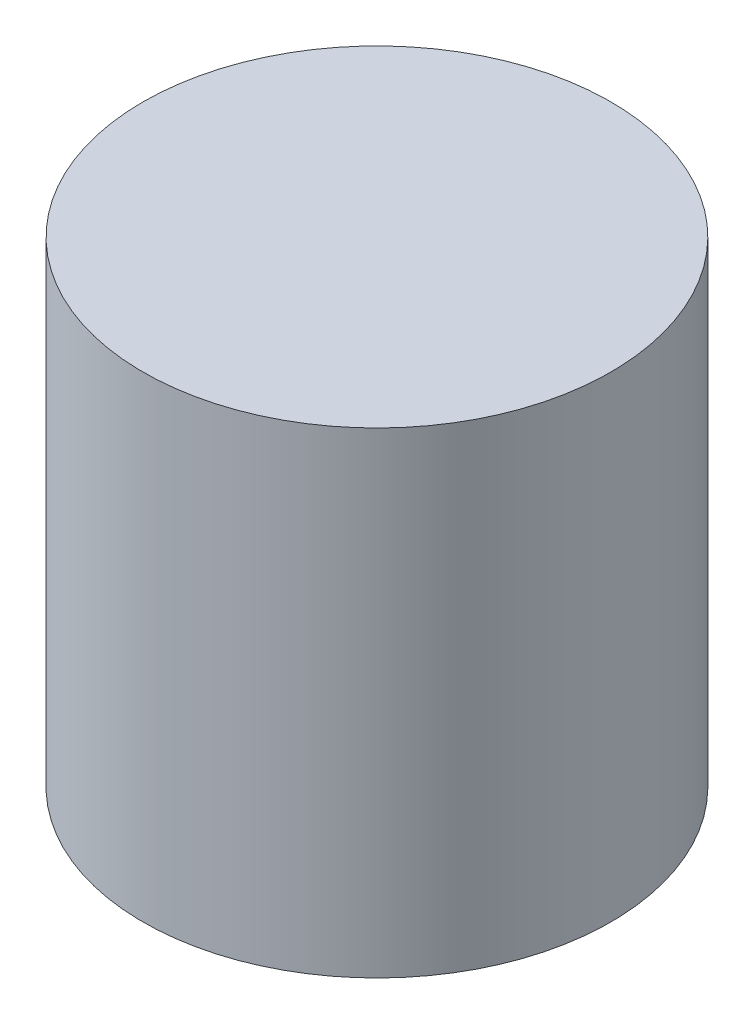
ISO-10303-21;
HEADER;
FILE_DESCRIPTION(('STEP AP214'),'2;1');
FILE_NAME('part.step','',(''),(''),'','','');
FILE_SCHEMA(('AUTOMOTIVE_DESIGN { 1 0 10303 214 1 1 1 1 }'));
ENDSEC;
DATA;
#1=APPLICATION_CONTEXT('core data for automotive mechanical design processes');
#2=APPLICATION_PROTOCOL_DEFINITION('international standard','automotive_design',2000,#1);
#3=PRODUCT_CONTEXT('',#1,'mechanical');
#4=PRODUCT('Part','Part','',(#3));
#5=PRODUCT_RELATED_PRODUCT_CATEGORY('part','',(#4));
#6=PRODUCT_DEFINITION_FORMATION('','',#4);
#7=PRODUCT_DEFINITION_CONTEXT('part definition',#1,'design');
#8=PRODUCT_DEFINITION('design','',#6,#7);
#9=PRODUCT_DEFINITION_SHAPE('','',#8);
#10=(LENGTH_UNIT() NAMED_UNIT(*) SI_UNIT(.MILLI.,.METRE.));
#11=(NAMED_UNIT(*) PLANE_ANGLE_UNIT() SI_UNIT($,.RADIAN.));
#12=(NAMED_UNIT(*) SI_UNIT($,.STERADIAN.) SOLID_ANGLE_UNIT());
#13=UNCERTAINTY_MEASURE_WITH_UNIT(LENGTH_MEASURE(1.E-05),#10,'distance_accuracy_value','');
#14=(GEOMETRIC_REPRESENTATION_CONTEXT(3) GLOBAL_UNCERTAINTY_ASSIGNED_CONTEXT((#13)) GLOBAL_UNIT_ASSIGNED_CONTEXT((#10,
#11,#12)) REPRESENTATION_CONTEXT('',''));
#15=CARTESIAN_POINT('',(0.,0.,0.));
#16=DIRECTION('',(0.,0.,1.));
#17=DIRECTION('',(1.,0.,0.));
#18=AXIS2_PLACEMENT_3D('',#15,#16,#17);
#19=CARTESIAN_POINT('',(0.,5.7,0.));
#20=DIRECTION('',(0.,1.,0.));
#21=DIRECTION('',(1.,0.,0.));
#22=AXIS2_PLACEMENT_3D('',#19,#20,#21);
#23=PLANE('',#22);
#24=CARTESIAN_POINT('',(0.,5.7,0.));
#25=DIRECTION('',(0.,1.,0.));
#26=DIRECTION('',(1.,0.,0.));
#27=AXIS2_PLACEMENT_3D('',#24,#25,#26);
#28=CIRCLE('',#27,2.8);
#29=CARTESIAN_POINT('',(-2.8,5.7,0.));
#30=VERTEX_POINT('',#29);
#31=EDGE_CURVE('E11',#30,#30,#28,.T.);
#32=ORIENTED_EDGE('',*,*,#31,.T.);
#33=EDGE_LOOP('',(#32));
#34=FACE_BOUND('',#33,.T.);
#35=ADVANCED_FACE('F16',(#34),#23,.T.);
#36=CARTESIAN_POINT('',(0.,0.,0.));
#37=DIRECTION('',(0.,1.,0.));
#38=DIRECTION('',(1.,0.,0.));
#39=AXIS2_PLACEMENT_3D('',#36,#37,#38);
#40=CYLINDRICAL_SURFACE('',#39,2.8);
#41=CARTESIAN_POINT('',(0.,0.,0.));
#42=DIRECTION('',(0.,1.,0.));
#43=DIRECTION('',(1.,0.,0.));
#44=AXIS2_PLACEMENT_3D('',#41,#42,#43);
#45=CIRCLE('',#44,2.8);
#46=CARTESIAN_POINT('',(-2.8,0.,0.));
#47=VERTEX_POINT('',#46);
#48=EDGE_CURVE('E211',#47,#47,#45,.T.);
#49=ORIENTED_EDGE('',*,*,#48,.T.);
#50=EDGE_LOOP('',(#49));
#51=FACE_BOUND('',#50,.T.);
#52=ORIENTED_EDGE('',*,*,#31,.F.);
#53=EDGE_LOOP('',(#52));
#54=FACE_BOUND('',#53,.T.);
#55=ADVANCED_FACE('F595',(#51,#54),#40,.T.);
#56=CARTESIAN_POINT('',(-2.05,0.,0.585));
#57=DIRECTION('',(1.,0.,0.));
#58=DIRECTION('',(0.,1.,0.));
#59=AXIS2_PLACEMENT_3D('',#56,#57,#58);
#60=PLANE('',#59);
#61=DIRECTION('',(0.,0.,1.));
#62=VECTOR('',#61,1.);
#63=CARTESIAN_POINT('',(-2.05,0.3,0.2925));
#64=LINE('',#63,#62);
#65=CARTESIAN_POINT('',(-2.05,0.3,-0.585));
#66=VERTEX_POINT('',#65);
#67=CARTESIAN_POINT('',(-2.05,0.3,0.585));
#68=VERTEX_POINT('',#67);
#69=EDGE_CURVE('E305',#66,#68,#64,.T.);
#70=ORIENTED_EDGE('',*,*,#69,.F.);
#71=DIRECTION('',(0.,1.,0.));
#72=VECTOR('',#71,1.);
#73=CARTESIAN_POINT('',(-2.05,0.,-0.585));
#74=LINE('',#73,#72);
#75=CARTESIAN_POINT('',(-2.05,4.7,-0.585));
#76=VERTEX_POINT('',#75);
#77=EDGE_CURVE('E27',#66,#76,#74,.T.);
#78=ORIENTED_EDGE('',*,*,#77,.T.);
#79=DIRECTION('',(0.,0.,1.));
#80=VECTOR('',#79,1.);
#81=CARTESIAN_POINT('',(-2.05,4.7,0.2925));
#82=LINE('',#81,#80);
#83=CARTESIAN_POINT('',(-2.05,4.7,0.585));
#84=VERTEX_POINT('',#83);
#85=EDGE_CURVE('E263',#76,#84,#82,.T.);
#86=ORIENTED_EDGE('',*,*,#85,.T.);
#87=DIRECTION('',(0.,1.,0.));
#88=VECTOR('',#87,1.);
#89=CARTESIAN_POINT('',(-2.05,0.,0.585));
#90=LINE('',#89,#88);
#91=EDGE_CURVE('E298',#68,#84,#90,.T.);
#92=ORIENTED_EDGE('',*,*,#91,.F.);
#93=EDGE_LOOP('',(#70,#78,#86,#92));
#94=FACE_BOUND('',#93,.T.);
#95=ADVANCED_FACE('F404',(#94),#60,.T.);
#96=CARTESIAN_POINT('',(-2.05,0.,-0.585));
#97=DIRECTION('',(0.,0.,1.));
#98=DIRECTION('',(1.,0.,0.));
#99=AXIS2_PLACEMENT_3D('',#96,#97,#98);
#100=PLANE('',#99);
#101=DIRECTION('',(-1.,0.,0.));
#102=VECTOR('',#101,1.);
#103=CARTESIAN_POINT('',(-1.025,0.3,-0.585));
#104=LINE('',#103,#102);
#105=CARTESIAN_POINT('',(-0.585,0.3,-0.585));
#106=VERTEX_POINT('',#105);
#107=EDGE_CURVE('E238',#106,#66,#104,.T.);
#108=ORIENTED_EDGE('',*,*,#107,.F.);
#109=DIRECTION('',(0.,1.,0.));
#110=VECTOR('',#109,1.);
#111=CARTESIAN_POINT('',(-0.585,0.,-0.585));
#112=LINE('',#111,#110);
#113=CARTESIAN_POINT('',(-0.585,4.7,-0.585));
#114=VERTEX_POINT('',#113);
#115=EDGE_CURVE('E257',#106,#114,#112,.T.);
#116=ORIENTED_EDGE('',*,*,#115,.T.);
#117=DIRECTION('',(-1.,0.,0.));
#118=VECTOR('',#117,1.);
#119=CARTESIAN_POINT('',(-1.025,4.7,-0.585));
#120=LINE('',#119,#118);
#121=EDGE_CURVE('E267',#114,#76,#120,.T.);
#122=ORIENTED_EDGE('',*,*,#121,.T.);
#123=ORIENTED_EDGE('',*,*,#77,.F.);
#124=EDGE_LOOP('',(#108,#116,#122,#123));
#125=FACE_BOUND('',#124,.T.);
#126=ADVANCED_FACE('F400',(#125),#100,.T.);
#127=CARTESIAN_POINT('',(0.585,0.,0.585));
#128=DIRECTION('',(-1.,0.,0.));
#129=DIRECTION('',(0.,0.,1.));
#130=AXIS2_PLACEMENT_3D('',#127,#128,#129);
#131=PLANE('',#130);
#132=DIRECTION('',(0.,0.,-1.));
#133=VECTOR('',#132,1.);
#134=CARTESIAN_POINT('',(0.585,0.3,0.2925));
#135=LINE('',#134,#133);
#136=CARTESIAN_POINT('',(0.585,0.3,2.05));
#137=VERTEX_POINT('',#136);
#138=CARTESIAN_POINT('',(0.585,0.3,0.585));
#139=VERTEX_POINT('',#138);
#140=EDGE_CURVE('E321',#137,#139,#135,.T.);
#141=ORIENTED_EDGE('',*,*,#140,.F.);
#142=DIRECTION('',(0.,1.,0.));
#143=VECTOR('',#142,1.);
#144=CARTESIAN_POINT('',(0.585,0.,2.05));
#145=LINE('',#144,#143);
#146=CARTESIAN_POINT('',(0.585,4.7,2.05));
#147=VERTEX_POINT('',#146);
#148=EDGE_CURVE('E170',#137,#147,#145,.T.);
#149=ORIENTED_EDGE('',*,*,#148,.T.);
#150=DIRECTION('',(0.,0.,-1.));
#151=VECTOR('',#150,1.);
#152=CARTESIAN_POINT('',(0.585,4.7,0.2925));
#153=LINE('',#152,#151);
#154=CARTESIAN_POINT('',(0.585,4.7,0.585));
#155=VERTEX_POINT('',#154);
#156=EDGE_CURVE('E204',#147,#155,#153,.T.);
#157=ORIENTED_EDGE('',*,*,#156,.T.);
#158=DIRECTION('',(0.,1.,0.));
#159=VECTOR('',#158,1.);
#160=CARTESIAN_POINT('',(0.585,0.,0.585));
#161=LINE('',#160,#159);
#162=EDGE_CURVE('E270',#139,#155,#161,.T.);
#163=ORIENTED_EDGE('',*,*,#162,.F.);
#164=EDGE_LOOP('',(#141,#149,#157,#163));
#165=FACE_BOUND('',#164,.T.);
#166=ADVANCED_FACE('F642',(#165),#131,.T.);
#167=CARTESIAN_POINT('',(0.585,0.,2.05));
#168=DIRECTION('',(0.,0.,-1.));
#169=DIRECTION('',(0.,-1.,0.));
#170=AXIS2_PLACEMENT_3D('',#167,#168,#169);
#171=PLANE('',#170);
#172=DIRECTION('',(1.,0.,0.));
#173=VECTOR('',#172,1.);
#174=CARTESIAN_POINT('',(0.2925,0.3,2.05));
#175=LINE('',#174,#173);
#176=CARTESIAN_POINT('',(-0.585,0.3,2.05));
#177=VERTEX_POINT('',#176);
#178=EDGE_CURVE('E184',#177,#137,#175,.T.);
#179=ORIENTED_EDGE('',*,*,#178,.F.);
#180=DIRECTION('',(0.,1.,0.));
#181=VECTOR('',#180,1.);
#182=CARTESIAN_POINT('',(-0.585,0.,2.05));
#183=LINE('',#182,#181);
#184=CARTESIAN_POINT('',(-0.585,4.7,2.05));
#185=VERTEX_POINT('',#184);
#186=EDGE_CURVE('E177',#177,#185,#183,.T.);
#187=ORIENTED_EDGE('',*,*,#186,.T.);
#188=DIRECTION('',(1.,0.,0.));
#189=VECTOR('',#188,1.);
#190=CARTESIAN_POINT('',(0.2925,4.7,2.05));
#191=LINE('',#190,#189);
#192=EDGE_CURVE('E181',#185,#147,#191,.T.);
#193=ORIENTED_EDGE('',*,*,#192,.T.);
#194=ORIENTED_EDGE('',*,*,#148,.F.);
#195=EDGE_LOOP('',(#179,#187,#193,#194));
#196=FACE_BOUND('',#195,.T.);
#197=ADVANCED_FACE('F179',(#196),#171,.T.);
#198=CARTESIAN_POINT('',(-0.585,0.,2.05));
#199=DIRECTION('',(1.,0.,0.));
#200=DIRECTION('',(0.,1.,0.));
#201=AXIS2_PLACEMENT_3D('',#198,#199,#200);
#202=PLANE('',#201);
#203=DIRECTION('',(0.,0.,1.));
#204=VECTOR('',#203,1.);
#205=CARTESIAN_POINT('',(-0.585,0.3,1.025));
#206=LINE('',#205,#204);
#207=CARTESIAN_POINT('',(-0.585,0.3,0.585));
#208=VERTEX_POINT('',#207);
#209=EDGE_CURVE('E292',#208,#177,#206,.T.);
#210=ORIENTED_EDGE('',*,*,#209,.F.);
#211=DIRECTION('',(0.,1.,0.));
#212=VECTOR('',#211,1.);
#213=CARTESIAN_POINT('',(-0.585,0.,0.585));
#214=LINE('',#213,#212);
#215=CARTESIAN_POINT('',(-0.585,4.7,0.585));
#216=VERTEX_POINT('',#215);
#217=EDGE_CURVE('E190',#208,#216,#214,.T.);
#218=ORIENTED_EDGE('',*,*,#217,.T.);
#219=DIRECTION('',(0.,0.,1.));
#220=VECTOR('',#219,1.);
#221=CARTESIAN_POINT('',(-0.585,4.7,1.025));
#222=LINE('',#221,#220);
#223=EDGE_CURVE('E193',#216,#185,#222,.T.);
#224=ORIENTED_EDGE('',*,*,#223,.T.);
#225=ORIENTED_EDGE('',*,*,#186,.F.);
#226=EDGE_LOOP('',(#210,#218,#224,#225));
#227=FACE_BOUND('',#226,.T.);
#228=ADVANCED_FACE('F194',(#227),#202,.T.);
#229=CARTESIAN_POINT('',(-0.585,0.,0.585));
#230=DIRECTION('',(0.,0.,-1.));
#231=DIRECTION('',(0.,-1.,0.));
#232=AXIS2_PLACEMENT_3D('',#229,#230,#231);
#233=PLANE('',#232);
#234=DIRECTION('',(1.,0.,0.));
#235=VECTOR('',#234,1.);
#236=CARTESIAN_POINT('',(-0.2925,0.3,0.585));
#237=LINE('',#236,#235);
#238=EDGE_CURVE('E256',#68,#208,#237,.T.);
#239=ORIENTED_EDGE('',*,*,#238,.F.);
#240=ORIENTED_EDGE('',*,*,#91,.T.);
#241=DIRECTION('',(1.,0.,0.));
#242=VECTOR('',#241,1.);
#243=CARTESIAN_POINT('',(-0.2925,4.7,0.585));
#244=LINE('',#243,#242);
#245=EDGE_CURVE('E199',#84,#216,#244,.T.);
#246=ORIENTED_EDGE('',*,*,#245,.T.);
#247=ORIENTED_EDGE('',*,*,#217,.F.);
#248=EDGE_LOOP('',(#239,#240,#246,#247));
#249=FACE_BOUND('',#248,.T.);
#250=ADVANCED_FACE('F445',(#249),#233,.T.);
#251=CARTESIAN_POINT('',(0.,4.7,0.));
#252=DIRECTION('',(0.,-1.,0.));
#253=DIRECTION('',(0.,0.,-1.));
#254=AXIS2_PLACEMENT_3D('',#251,#252,#253);
#255=PLANE('',#254);
#256=DIRECTION('',(-1.,0.,0.));
#257=VECTOR('',#256,1.);
#258=CARTESIAN_POINT('',(0.2925,4.7,-0.585));
#259=LINE('',#258,#257);
#260=CARTESIAN_POINT('',(2.05,4.7,-0.585));
#261=VERTEX_POINT('',#260);
#262=CARTESIAN_POINT('',(0.585,4.7,-0.585));
#263=VERTEX_POINT('',#262);
#264=EDGE_CURVE('E233',#261,#263,#259,.T.);
#265=ORIENTED_EDGE('',*,*,#264,.F.);
#266=DIRECTION('',(0.,0.,-1.));
#267=VECTOR('',#266,1.);
#268=CARTESIAN_POINT('',(2.05,4.7,-0.2925));
#269=LINE('',#268,#267);
#270=CARTESIAN_POINT('',(2.05,4.7,0.585));
#271=VERTEX_POINT('',#270);
#272=EDGE_CURVE('E232',#271,#261,#269,.T.);
#273=ORIENTED_EDGE('',*,*,#272,.F.);
#274=DIRECTION('',(1.,0.,0.));
#275=VECTOR('',#274,1.);
#276=CARTESIAN_POINT('',(1.025,4.7,0.585));
#277=LINE('',#276,#275);
#278=EDGE_CURVE('E280',#155,#271,#277,.T.);
#279=ORIENTED_EDGE('',*,*,#278,.F.);
#280=ORIENTED_EDGE('',*,*,#156,.F.);
#281=ORIENTED_EDGE('',*,*,#192,.F.);
#282=ORIENTED_EDGE('',*,*,#223,.F.);
#283=ORIENTED_EDGE('',*,*,#245,.F.);
#284=ORIENTED_EDGE('',*,*,#85,.F.);
#285=ORIENTED_EDGE('',*,*,#121,.F.);
#286=DIRECTION('',(0.,0.,1.));
#287=VECTOR('',#286,1.);
#288=CARTESIAN_POINT('',(-0.585,4.7,-0.2925));
#289=LINE('',#288,#287);
#290=CARTESIAN_POINT('',(-0.585,4.7,-2.05));
#291=VERTEX_POINT('',#290);
#292=EDGE_CURVE('E262',#291,#114,#289,.T.);
#293=ORIENTED_EDGE('',*,*,#292,.F.);
#294=DIRECTION('',(-1.,0.,0.));
#295=VECTOR('',#294,1.);
#296=CARTESIAN_POINT('',(-0.2925,4.7,-2.05));
#297=LINE('',#296,#295);
#298=CARTESIAN_POINT('',(0.585,4.7,-2.05));
#299=VERTEX_POINT('',#298);
#300=EDGE_CURVE('E348',#299,#291,#297,.T.);
#301=ORIENTED_EDGE('',*,*,#300,.F.);
#302=DIRECTION('',(0.,0.,-1.));
#303=VECTOR('',#302,1.);
#304=CARTESIAN_POINT('',(0.585,4.7,-1.025));
#305=LINE('',#304,#303);
#306=EDGE_CURVE('E328',#263,#299,#305,.T.);
#307=ORIENTED_EDGE('',*,*,#306,.F.);
#308=EDGE_LOOP('',(#265,#273,#279,#280,#281,#282,#283,#284,#285,#293,#301,#307));
#309=FACE_BOUND('',#308,.T.);
#310=ADVANCED_FACE('F202',(#309),#255,.T.);
#311=CARTESIAN_POINT('',(0.,0.,0.));
#312=DIRECTION('',(0.,1.,0.));
#313=DIRECTION('',(1.,0.,0.));
#314=AXIS2_PLACEMENT_3D('',#311,#312,#313);
#315=PLANE('',#314);
#316=DIRECTION('',(-1.,0.,0.));
#317=VECTOR('',#316,1.);
#318=CARTESIAN_POINT('',(1.025,0.,0.885));
#319=LINE('',#318,#317);
#320=CARTESIAN_POINT('',(2.35,0.,0.885));
#321=VERTEX_POINT('',#320);
#322=CARTESIAN_POINT('',(0.885,0.,0.885));
#323=VERTEX_POINT('',#322);
#324=EDGE_CURVE('E315',#321,#323,#319,.T.);
#325=ORIENTED_EDGE('',*,*,#324,.F.);
#326=DIRECTION('',(0.,0.,1.));
#327=VECTOR('',#326,1.);
#328=CARTESIAN_POINT('',(2.35,0.,-0.2925));
#329=LINE('',#328,#327);
#330=CARTESIAN_POINT('',(2.35,0.,-0.885));
#331=VERTEX_POINT('',#330);
#332=EDGE_CURVE('E250',#331,#321,#329,.T.);
#333=ORIENTED_EDGE('',*,*,#332,.F.);
#334=DIRECTION('',(1.,0.,0.));
#335=VECTOR('',#334,1.);
#336=CARTESIAN_POINT('',(0.2925,0.,-0.885));
#337=LINE('',#336,#335);
#338=CARTESIAN_POINT('',(0.885,0.,-0.885));
#339=VERTEX_POINT('',#338);
#340=EDGE_CURVE('E221',#339,#331,#337,.T.);
#341=ORIENTED_EDGE('',*,*,#340,.F.);
#342=DIRECTION('',(0.,0.,1.));
#343=VECTOR('',#342,1.);
#344=CARTESIAN_POINT('',(0.885,0.,-1.025));
#345=LINE('',#344,#343);
#346=CARTESIAN_POINT('',(0.885,0.,-2.35));
#347=VERTEX_POINT('',#346);
#348=EDGE_CURVE('E222',#347,#339,#345,.T.);
#349=ORIENTED_EDGE('',*,*,#348,.F.);
#350=DIRECTION('',(1.,0.,0.));
#351=VECTOR('',#350,1.);
#352=CARTESIAN_POINT('',(-0.2925,0.,-2.35));
#353=LINE('',#352,#351);
#354=CARTESIAN_POINT('',(-0.885,0.,-2.35));
#355=VERTEX_POINT('',#354);
#356=EDGE_CURVE('E271',#355,#347,#353,.T.);
#357=ORIENTED_EDGE('',*,*,#356,.F.);
#358=DIRECTION('',(0.,0.,-1.));
#359=VECTOR('',#358,1.);
#360=CARTESIAN_POINT('',(-0.885,0.,-0.2925));
#361=LINE('',#360,#359);
#362=CARTESIAN_POINT('',(-0.885,0.,-0.885));
#363=VERTEX_POINT('',#362);
#364=EDGE_CURVE('E20',#363,#355,#361,.T.);
#365=ORIENTED_EDGE('',*,*,#364,.F.);
#366=DIRECTION('',(1.,0.,0.));
#367=VECTOR('',#366,1.);
#368=CARTESIAN_POINT('',(-1.025,0.,-0.885));
#369=LINE('',#368,#367);
#370=CARTESIAN_POINT('',(-2.35,0.,-0.885));
#371=VERTEX_POINT('',#370);
#372=EDGE_CURVE('E355',#371,#363,#369,.T.);
#373=ORIENTED_EDGE('',*,*,#372,.F.);
#374=DIRECTION('',(0.,0.,-1.));
#375=VECTOR('',#374,1.);
#376=CARTESIAN_POINT('',(-2.35,0.,0.2925));
#377=LINE('',#376,#375);
#378=CARTESIAN_POINT('',(-2.35,0.,0.885));
#379=VERTEX_POINT('',#378);
#380=EDGE_CURVE('E239',#379,#371,#377,.T.);
#381=ORIENTED_EDGE('',*,*,#380,.F.);
#382=DIRECTION('',(-1.,0.,0.));
#383=VECTOR('',#382,1.);
#384=CARTESIAN_POINT('',(-0.2925,0.,0.885));
#385=LINE('',#384,#383);
#386=CARTESIAN_POINT('',(-0.885,0.,0.885));
#387=VERTEX_POINT('',#386);
#388=EDGE_CURVE('E251',#387,#379,#385,.T.);
#389=ORIENTED_EDGE('',*,*,#388,.F.);
#390=DIRECTION('',(0.,0.,-1.));
#391=VECTOR('',#390,1.);
#392=CARTESIAN_POINT('',(-0.885,0.,1.025));
#393=LINE('',#392,#391);
#394=CARTESIAN_POINT('',(-0.885,0.,2.35));
#395=VERTEX_POINT('',#394);
#396=EDGE_CURVE('E295',#395,#387,#393,.T.);
#397=ORIENTED_EDGE('',*,*,#396,.F.);
#398=DIRECTION('',(-1.,0.,0.));
#399=VECTOR('',#398,1.);
#400=CARTESIAN_POINT('',(0.2925,0.,2.35));
#401=LINE('',#400,#399);
#402=CARTESIAN_POINT('',(0.885,0.,2.35));
#403=VERTEX_POINT('',#402);
#404=EDGE_CURVE('E316',#403,#395,#401,.T.);
#405=ORIENTED_EDGE('',*,*,#404,.F.);
#406=DIRECTION('',(0.,0.,1.));
#407=VECTOR('',#406,1.);
#408=CARTESIAN_POINT('',(0.885,0.,0.2925));
#409=LINE('',#408,#407);
#410=EDGE_CURVE('E290',#323,#403,#409,.T.);
#411=ORIENTED_EDGE('',*,*,#410,.F.);
#412=EDGE_LOOP('',(#325,#333,#341,#349,#357,#365,#373,#381,#389,#397,#405,#411));
#413=FACE_BOUND('',#412,.T.);
#414=ORIENTED_EDGE('',*,*,#48,.F.);
#415=EDGE_LOOP('',(#414));
#416=FACE_BOUND('',#415,.T.);
#417=ADVANCED_FACE('F677',(#413,#416),#315,.F.);
#418=CARTESIAN_POINT('',(2.05,0.,0.585));
#419=DIRECTION('',(0.,0.,-1.));
#420=DIRECTION('',(0.,-1.,0.));
#421=AXIS2_PLACEMENT_3D('',#418,#419,#420);
#422=PLANE('',#421);
#423=DIRECTION('',(1.,0.,0.));
#424=VECTOR('',#423,1.);
#425=CARTESIAN_POINT('',(1.025,0.3,0.585));
#426=LINE('',#425,#424);
#427=CARTESIAN_POINT('',(2.05,0.3,0.585));
#428=VERTEX_POINT('',#427);
#429=EDGE_CURVE('E291',#139,#428,#426,.T.);
#430=ORIENTED_EDGE('',*,*,#429,.F.);
#431=ORIENTED_EDGE('',*,*,#162,.T.);
#432=ORIENTED_EDGE('',*,*,#278,.T.);
#433=DIRECTION('',(0.,1.,0.));
#434=VECTOR('',#433,1.);
#435=CARTESIAN_POINT('',(2.05,0.,0.585));
#436=LINE('',#435,#434);
#437=EDGE_CURVE('E228',#428,#271,#436,.T.);
#438=ORIENTED_EDGE('',*,*,#437,.F.);
#439=EDGE_LOOP('',(#430,#431,#432,#438));
#440=FACE_BOUND('',#439,.T.);
#441=ADVANCED_FACE('F604',(#440),#422,.T.);
#442=CARTESIAN_POINT('',(2.05,0.,-0.585));
#443=DIRECTION('',(-1.,0.,0.));
#444=DIRECTION('',(0.,0.,1.));
#445=AXIS2_PLACEMENT_3D('',#442,#443,#444);
#446=PLANE('',#445);
#447=DIRECTION('',(0.,0.,-1.));
#448=VECTOR('',#447,1.);
#449=CARTESIAN_POINT('',(2.05,0.3,-0.2925));
#450=LINE('',#449,#448);
#451=CARTESIAN_POINT('',(2.05,0.3,-0.585));
#452=VERTEX_POINT('',#451);
#453=EDGE_CURVE('E245',#428,#452,#450,.T.);
#454=ORIENTED_EDGE('',*,*,#453,.F.);
#455=ORIENTED_EDGE('',*,*,#437,.T.);
#456=ORIENTED_EDGE('',*,*,#272,.T.);
#457=DIRECTION('',(0.,1.,0.));
#458=VECTOR('',#457,1.);
#459=CARTESIAN_POINT('',(2.05,0.,-0.585));
#460=LINE('',#459,#458);
#461=EDGE_CURVE('E242',#452,#261,#460,.T.);
#462=ORIENTED_EDGE('',*,*,#461,.F.);
#463=EDGE_LOOP('',(#454,#455,#456,#462));
#464=FACE_BOUND('',#463,.T.);
#465=ADVANCED_FACE('F560',(#464),#446,.T.);
#466=CARTESIAN_POINT('',(0.585,0.,-0.585));
#467=DIRECTION('',(0.,0.,1.));
#468=DIRECTION('',(1.,0.,0.));
#469=AXIS2_PLACEMENT_3D('',#466,#467,#468);
#470=PLANE('',#469);
#471=DIRECTION('',(-1.,0.,0.));
#472=VECTOR('',#471,1.);
#473=CARTESIAN_POINT('',(0.2925,0.3,-0.585));
#474=LINE('',#473,#472);
#475=CARTESIAN_POINT('',(0.585,0.3,-0.585));
#476=VERTEX_POINT('',#475);
#477=EDGE_CURVE('E215',#452,#476,#474,.T.);
#478=ORIENTED_EDGE('',*,*,#477,.F.);
#479=ORIENTED_EDGE('',*,*,#461,.T.);
#480=ORIENTED_EDGE('',*,*,#264,.T.);
#481=DIRECTION('',(0.,1.,0.));
#482=VECTOR('',#481,1.);
#483=CARTESIAN_POINT('',(0.585,0.,-0.585));
#484=LINE('',#483,#482);
#485=EDGE_CURVE('E331',#476,#263,#484,.T.);
#486=ORIENTED_EDGE('',*,*,#485,.F.);
#487=EDGE_LOOP('',(#478,#479,#480,#486));
#488=FACE_BOUND('',#487,.T.);
#489=ADVANCED_FACE('F554',(#488),#470,.T.);
#490=CARTESIAN_POINT('',(0.585,0.,-2.05));
#491=DIRECTION('',(-1.,0.,0.));
#492=DIRECTION('',(0.,0.,1.));
#493=AXIS2_PLACEMENT_3D('',#490,#491,#492);
#494=PLANE('',#493);
#495=DIRECTION('',(0.,0.,-1.));
#496=VECTOR('',#495,1.);
#497=CARTESIAN_POINT('',(0.585,0.3,-1.025));
#498=LINE('',#497,#496);
#499=CARTESIAN_POINT('',(0.585,0.3,-2.05));
#500=VERTEX_POINT('',#499);
#501=EDGE_CURVE('E227',#476,#500,#498,.T.);
#502=ORIENTED_EDGE('',*,*,#501,.F.);
#503=ORIENTED_EDGE('',*,*,#485,.T.);
#504=ORIENTED_EDGE('',*,*,#306,.T.);
#505=DIRECTION('',(0.,1.,0.));
#506=VECTOR('',#505,1.);
#507=CARTESIAN_POINT('',(0.585,0.,-2.05));
#508=LINE('',#507,#506);
#509=EDGE_CURVE('E261',#500,#299,#508,.T.);
#510=ORIENTED_EDGE('',*,*,#509,.F.);
#511=EDGE_LOOP('',(#502,#503,#504,#510));
#512=FACE_BOUND('',#511,.T.);
#513=ADVANCED_FACE('F559',(#512),#494,.T.);
#514=CARTESIAN_POINT('',(-0.585,0.,-2.05));
#515=DIRECTION('',(0.,0.,1.));
#516=DIRECTION('',(1.,0.,0.));
#517=AXIS2_PLACEMENT_3D('',#514,#515,#516);
#518=PLANE('',#517);
#519=DIRECTION('',(-1.,0.,0.));
#520=VECTOR('',#519,1.);
#521=CARTESIAN_POINT('',(-0.2925,0.3,-2.05));
#522=LINE('',#521,#520);
#523=CARTESIAN_POINT('',(-0.585,0.3,-2.05));
#524=VERTEX_POINT('',#523);
#525=EDGE_CURVE('E276',#500,#524,#522,.T.);
#526=ORIENTED_EDGE('',*,*,#525,.F.);
#527=ORIENTED_EDGE('',*,*,#509,.T.);
#528=ORIENTED_EDGE('',*,*,#300,.T.);
#529=DIRECTION('',(0.,1.,0.));
#530=VECTOR('',#529,1.);
#531=CARTESIAN_POINT('',(-0.585,0.,-2.05));
#532=LINE('',#531,#530);
#533=EDGE_CURVE('E226',#524,#291,#532,.T.);
#534=ORIENTED_EDGE('',*,*,#533,.F.);
#535=EDGE_LOOP('',(#526,#527,#528,#534));
#536=FACE_BOUND('',#535,.T.);
#537=ADVANCED_FACE('F380',(#536),#518,.T.);
#538=CARTESIAN_POINT('',(-0.585,0.,-0.585));
#539=DIRECTION('',(1.,0.,0.));
#540=DIRECTION('',(0.,1.,0.));
#541=AXIS2_PLACEMENT_3D('',#538,#539,#540);
#542=PLANE('',#541);
#543=DIRECTION('',(0.,0.,1.));
#544=VECTOR('',#543,1.);
#545=CARTESIAN_POINT('',(-0.585,0.3,-0.2925));
#546=LINE('',#545,#544);
#547=EDGE_CURVE('E249',#524,#106,#546,.T.);
#548=ORIENTED_EDGE('',*,*,#547,.F.);
#549=ORIENTED_EDGE('',*,*,#533,.T.);
#550=ORIENTED_EDGE('',*,*,#292,.T.);
#551=ORIENTED_EDGE('',*,*,#115,.F.);
#552=EDGE_LOOP('',(#548,#549,#550,#551));
#553=FACE_BOUND('',#552,.T.);
#554=ADVANCED_FACE('F386',(#553),#542,.T.);
#555=CARTESIAN_POINT('',(0.735,0.15,-1.025));
#556=DIRECTION('',(-0.707106781186548,-0.707106781186548,0.));
#557=DIRECTION('',(-0.707106781186548,0.707106781186548,0.));
#558=AXIS2_PLACEMENT_3D('',#555,#556,#557);
#559=PLANE('',#558);
#560=ORIENTED_EDGE('',*,*,#501,.T.);
#561=DIRECTION('',(-0.577350269189626,0.577350269189626,0.577350269189626));
#562=VECTOR('',#561,1.);
#563=CARTESIAN_POINT('',(0.885,0.,-2.35));
#564=LINE('',#563,#562);
#565=EDGE_CURVE('E275',#347,#500,#564,.T.);
#566=ORIENTED_EDGE('',*,*,#565,.F.);
#567=ORIENTED_EDGE('',*,*,#348,.T.);
#568=DIRECTION('',(-0.577350269189626,0.577350269189626,0.577350269189626));
#569=VECTOR('',#568,1.);
#570=CARTESIAN_POINT('',(0.885,0.,-0.885));
#571=LINE('',#570,#569);
#572=EDGE_CURVE('E369',#339,#476,#571,.T.);
#573=ORIENTED_EDGE('',*,*,#572,.T.);
#574=EDGE_LOOP('',(#560,#566,#567,#573));
#575=FACE_BOUND('',#574,.T.);
#576=ADVANCED_FACE('F367',(#575),#559,.T.);
#577=CARTESIAN_POINT('',(-0.2925,0.15,-2.2));
#578=DIRECTION('',(0.,-0.707106781186548,0.707106781186548));
#579=DIRECTION('',(-1.,0.,0.));
#580=AXIS2_PLACEMENT_3D('',#577,#578,#579);
#581=PLANE('',#580);
#582=ORIENTED_EDGE('',*,*,#525,.T.);
#583=DIRECTION('',(0.577350269189626,0.577350269189626,0.577350269189626));
#584=VECTOR('',#583,1.);
#585=CARTESIAN_POINT('',(-0.885,0.,-2.35));
#586=LINE('',#585,#584);
#587=EDGE_CURVE('E310',#355,#524,#586,.T.);
#588=ORIENTED_EDGE('',*,*,#587,.F.);
#589=ORIENTED_EDGE('',*,*,#356,.T.);
#590=ORIENTED_EDGE('',*,*,#565,.T.);
#591=EDGE_LOOP('',(#582,#588,#589,#590));
#592=FACE_BOUND('',#591,.T.);
#593=ADVANCED_FACE('F374',(#592),#581,.T.);
#594=CARTESIAN_POINT('',(-0.735,0.15,-0.2925));
#595=DIRECTION('',(0.707106781186548,-0.707106781186548,0.));
#596=DIRECTION('',(0.,0.,-1.));
#597=AXIS2_PLACEMENT_3D('',#594,#595,#596);
#598=PLANE('',#597);
#599=ORIENTED_EDGE('',*,*,#547,.T.);
#600=DIRECTION('',(0.577350269189626,0.577350269189626,0.577350269189626));
#601=VECTOR('',#600,1.);
#602=CARTESIAN_POINT('',(-0.885,0.,-0.885));
#603=LINE('',#602,#601);
#604=EDGE_CURVE('E339',#363,#106,#603,.T.);
#605=ORIENTED_EDGE('',*,*,#604,.F.);
#606=ORIENTED_EDGE('',*,*,#364,.T.);
#607=ORIENTED_EDGE('',*,*,#587,.T.);
#608=EDGE_LOOP('',(#599,#605,#606,#607));
#609=FACE_BOUND('',#608,.T.);
#610=ADVANCED_FACE('F390',(#609),#598,.T.);
#611=CARTESIAN_POINT('',(2.2,0.15,-0.2925));
#612=DIRECTION('',(-0.707106781186548,-0.707106781186548,0.));
#613=DIRECTION('',(-0.707106781186548,0.707106781186548,0.));
#614=AXIS2_PLACEMENT_3D('',#611,#612,#613);
#615=PLANE('',#614);
#616=ORIENTED_EDGE('',*,*,#332,.T.);
#617=DIRECTION('',(0.577350269189626,-0.577350269189626,0.577350269189626));
#618=VECTOR('',#617,1.);
#619=CARTESIAN_POINT('',(2.05,0.3,0.585));
#620=LINE('',#619,#618);
#621=EDGE_CURVE('E286',#428,#321,#620,.T.);
#622=ORIENTED_EDGE('',*,*,#621,.F.);
#623=ORIENTED_EDGE('',*,*,#453,.T.);
#624=DIRECTION('',(-0.577350269189626,0.577350269189626,0.577350269189626));
#625=VECTOR('',#624,1.);
#626=CARTESIAN_POINT('',(2.35,0.,-0.885));
#627=LINE('',#626,#625);
#628=EDGE_CURVE('E217',#331,#452,#627,.T.);
#629=ORIENTED_EDGE('',*,*,#628,.F.);
#630=EDGE_LOOP('',(#616,#622,#623,#629));
#631=FACE_BOUND('',#630,.T.);
#632=ADVANCED_FACE('F548',(#631),#615,.T.);
#633=CARTESIAN_POINT('',(-1.025,0.15,-0.735));
#634=DIRECTION('',(0.,-0.707106781186548,0.707106781186548));
#635=DIRECTION('',(-1.,0.,0.));
#636=AXIS2_PLACEMENT_3D('',#633,#634,#635);
#637=PLANE('',#636);
#638=ORIENTED_EDGE('',*,*,#107,.T.);
#639=DIRECTION('',(0.577350269189626,0.577350269189626,0.577350269189626));
#640=VECTOR('',#639,1.);
#641=CARTESIAN_POINT('',(-2.35,0.,-0.885));
#642=LINE('',#641,#640);
#643=EDGE_CURVE('E234',#371,#66,#642,.T.);
#644=ORIENTED_EDGE('',*,*,#643,.F.);
#645=ORIENTED_EDGE('',*,*,#372,.T.);
#646=ORIENTED_EDGE('',*,*,#604,.T.);
#647=EDGE_LOOP('',(#638,#644,#645,#646));
#648=FACE_BOUND('',#647,.T.);
#649=ADVANCED_FACE('F395',(#648),#637,.T.);
#650=CARTESIAN_POINT('',(-2.2,0.15,0.2925));
#651=DIRECTION('',(0.707106781186548,-0.707106781186548,0.));
#652=DIRECTION('',(0.,0.,-1.));
#653=AXIS2_PLACEMENT_3D('',#650,#651,#652);
#654=PLANE('',#653);
#655=ORIENTED_EDGE('',*,*,#69,.T.);
#656=DIRECTION('',(0.577350269189626,0.577350269189626,-0.577350269189626));
#657=VECTOR('',#656,1.);
#658=CARTESIAN_POINT('',(-2.35,0.,0.885));
#659=LINE('',#658,#657);
#660=EDGE_CURVE('E255',#379,#68,#659,.T.);
#661=ORIENTED_EDGE('',*,*,#660,.F.);
#662=ORIENTED_EDGE('',*,*,#380,.T.);
#663=ORIENTED_EDGE('',*,*,#643,.T.);
#664=EDGE_LOOP('',(#655,#661,#662,#663));
#665=FACE_BOUND('',#664,.T.);
#666=ADVANCED_FACE('F547',(#665),#654,.T.);
#667=CARTESIAN_POINT('',(-0.2925,0.15,0.735));
#668=DIRECTION('',(0.,-0.707106781186548,-0.707106781186548));
#669=DIRECTION('',(0.,-0.707106781186548,0.707106781186548));
#670=AXIS2_PLACEMENT_3D('',#667,#668,#669);
#671=PLANE('',#670);
#672=ORIENTED_EDGE('',*,*,#238,.T.);
#673=DIRECTION('',(0.577350269189626,0.577350269189626,-0.577350269189626));
#674=VECTOR('',#673,1.);
#675=CARTESIAN_POINT('',(-0.885,0.,0.885));
#676=LINE('',#675,#674);
#677=EDGE_CURVE('E302',#387,#208,#676,.T.);
#678=ORIENTED_EDGE('',*,*,#677,.F.);
#679=ORIENTED_EDGE('',*,*,#388,.T.);
#680=ORIENTED_EDGE('',*,*,#660,.T.);
#681=EDGE_LOOP('',(#672,#678,#679,#680));
#682=FACE_BOUND('',#681,.T.);
#683=ADVANCED_FACE('F449',(#682),#671,.T.);
#684=CARTESIAN_POINT('',(-0.735,0.15,1.025));
#685=DIRECTION('',(0.707106781186548,-0.707106781186548,0.));
#686=DIRECTION('',(0.,0.,-1.));
#687=AXIS2_PLACEMENT_3D('',#684,#685,#686);
#688=PLANE('',#687);
#689=ORIENTED_EDGE('',*,*,#209,.T.);
#690=DIRECTION('',(0.577350269189626,0.577350269189626,-0.577350269189626));
#691=VECTOR('',#690,1.);
#692=CARTESIAN_POINT('',(-0.885,0.,2.35));
#693=LINE('',#692,#691);
#694=EDGE_CURVE('E320',#395,#177,#693,.T.);
#695=ORIENTED_EDGE('',*,*,#694,.F.);
#696=ORIENTED_EDGE('',*,*,#396,.T.);
#697=ORIENTED_EDGE('',*,*,#677,.T.);
#698=EDGE_LOOP('',(#689,#695,#696,#697));
#699=FACE_BOUND('',#698,.T.);
#700=ADVANCED_FACE('F18',(#699),#688,.T.);
#701=CARTESIAN_POINT('',(0.2925,0.15,2.2));
#702=DIRECTION('',(0.,-0.707106781186548,-0.707106781186548));
#703=DIRECTION('',(0.,-0.707106781186548,0.707106781186548));
#704=AXIS2_PLACEMENT_3D('',#701,#702,#703);
#705=PLANE('',#704);
#706=ORIENTED_EDGE('',*,*,#404,.T.);
#707=ORIENTED_EDGE('',*,*,#694,.T.);
#708=ORIENTED_EDGE('',*,*,#178,.T.);
#709=DIRECTION('',(-0.577350269189626,0.577350269189626,-0.577350269189626));
#710=VECTOR('',#709,1.);
#711=CARTESIAN_POINT('',(0.885,0.,2.35));
#712=LINE('',#711,#710);
#713=EDGE_CURVE('E358',#403,#137,#712,.T.);
#714=ORIENTED_EDGE('',*,*,#713,.F.);
#715=EDGE_LOOP('',(#706,#707,#708,#714));
#716=FACE_BOUND('',#715,.T.);
#717=ADVANCED_FACE('F703',(#716),#705,.T.);
#718=CARTESIAN_POINT('',(0.735,0.15,0.2925));
#719=DIRECTION('',(-0.707106781186548,-0.707106781186548,0.));
#720=DIRECTION('',(-0.707106781186548,0.707106781186548,0.));
#721=AXIS2_PLACEMENT_3D('',#718,#719,#720);
#722=PLANE('',#721);
#723=ORIENTED_EDGE('',*,*,#410,.T.);
#724=ORIENTED_EDGE('',*,*,#713,.T.);
#725=ORIENTED_EDGE('',*,*,#140,.T.);
#726=DIRECTION('',(-0.577350269189626,0.577350269189626,-0.577350269189626));
#727=VECTOR('',#726,1.);
#728=CARTESIAN_POINT('',(0.885,0.,0.885));
#729=LINE('',#728,#727);
#730=EDGE_CURVE('E311',#323,#139,#729,.T.);
#731=ORIENTED_EDGE('',*,*,#730,.F.);
#732=EDGE_LOOP('',(#723,#724,#725,#731));
#733=FACE_BOUND('',#732,.T.);
#734=ADVANCED_FACE('F616',(#733),#722,.T.);
#735=CARTESIAN_POINT('',(1.025,0.15,0.735));
#736=DIRECTION('',(0.,-0.707106781186548,-0.707106781186548));
#737=DIRECTION('',(0.,-0.707106781186548,0.707106781186548));
#738=AXIS2_PLACEMENT_3D('',#735,#736,#737);
#739=PLANE('',#738);
#740=ORIENTED_EDGE('',*,*,#324,.T.);
#741=ORIENTED_EDGE('',*,*,#730,.T.);
#742=ORIENTED_EDGE('',*,*,#429,.T.);
#743=ORIENTED_EDGE('',*,*,#621,.T.);
#744=EDGE_LOOP('',(#740,#741,#742,#743));
#745=FACE_BOUND('',#744,.T.);
#746=ADVANCED_FACE('F610',(#745),#739,.T.);
#747=CARTESIAN_POINT('',(0.2925,0.15,-0.735));
#748=DIRECTION('',(0.,-0.707106781186548,0.707106781186548));
#749=DIRECTION('',(-1.,0.,0.));
#750=AXIS2_PLACEMENT_3D('',#747,#748,#749);
#751=PLANE('',#750);
#752=ORIENTED_EDGE('',*,*,#340,.T.);
#753=ORIENTED_EDGE('',*,*,#628,.T.);
#754=ORIENTED_EDGE('',*,*,#477,.T.);
#755=ORIENTED_EDGE('',*,*,#572,.F.);
#756=EDGE_LOOP('',(#752,#753,#754,#755));
#757=FACE_BOUND('',#756,.T.);
#758=ADVANCED_FACE('F615',(#757),#751,.T.);
#759=CLOSED_SHELL('',(#35,#55,#95,#126,#166,#197,#228,#250,#310,#417,#441,#465,#489,#513,#537,
#554,#576,#593,#610,#632,#649,#666,#683,#700,#717,#734,#746,#758));
#760=MANIFOLD_SOLID_BREP('B1',#759);
#761=ADVANCED_BREP_SHAPE_REPRESENTATION('',(#18,#760),#14);
#762=SHAPE_DEFINITION_REPRESENTATION(#9,#761);
ENDSEC;
END-ISO-10303-21;
